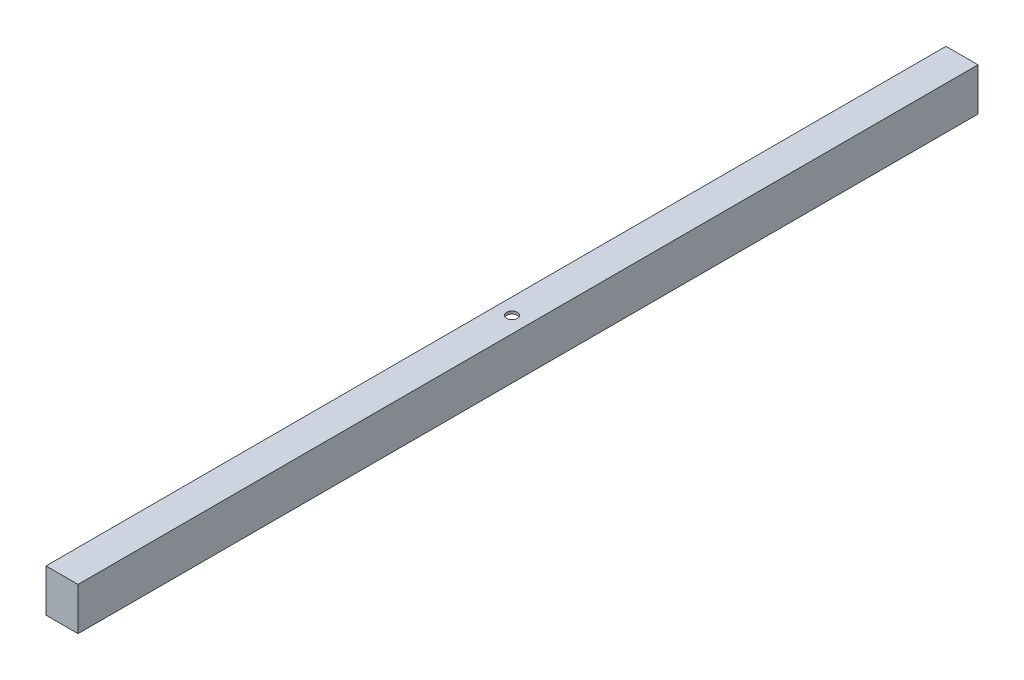
ISO-10303-21;
HEADER;
FILE_DESCRIPTION(('STEP AP214'),'2;1');
FILE_NAME('part.step','',(''),(''),'','','');
FILE_SCHEMA(('AUTOMOTIVE_DESIGN { 1 0 10303 214 1 1 1 1 }'));
ENDSEC;
DATA;
#1=APPLICATION_CONTEXT('core data for automotive mechanical design processes');
#2=APPLICATION_PROTOCOL_DEFINITION('international standard','automotive_design',2000,#1);
#3=PRODUCT_CONTEXT('',#1,'mechanical');
#4=PRODUCT('Part','Part','',(#3));
#5=PRODUCT_RELATED_PRODUCT_CATEGORY('part','',(#4));
#6=PRODUCT_DEFINITION_FORMATION('','',#4);
#7=PRODUCT_DEFINITION_CONTEXT('part definition',#1,'design');
#8=PRODUCT_DEFINITION('design','',#6,#7);
#9=PRODUCT_DEFINITION_SHAPE('','',#8);
#10=(LENGTH_UNIT() NAMED_UNIT(*) SI_UNIT(.MILLI.,.METRE.));
#11=(NAMED_UNIT(*) PLANE_ANGLE_UNIT() SI_UNIT($,.RADIAN.));
#12=(NAMED_UNIT(*) SI_UNIT($,.STERADIAN.) SOLID_ANGLE_UNIT());
#13=UNCERTAINTY_MEASURE_WITH_UNIT(LENGTH_MEASURE(1.E-05),#10,'distance_accuracy_value','');
#14=(GEOMETRIC_REPRESENTATION_CONTEXT(3) GLOBAL_UNCERTAINTY_ASSIGNED_CONTEXT((#13)) GLOBAL_UNIT_ASSIGNED_CONTEXT((#10,
#11,#12)) REPRESENTATION_CONTEXT('',''));
#15=CARTESIAN_POINT('',(0.,0.,0.));
#16=DIRECTION('',(0.,0.,1.));
#17=DIRECTION('',(1.,0.,0.));
#18=AXIS2_PLACEMENT_3D('',#15,#16,#17);
#19=CARTESIAN_POINT('',(0.,-23.8125,533.4));
#20=DIRECTION('',(0.,-1.,0.));
#21=DIRECTION('',(0.,0.,-1.));
#22=AXIS2_PLACEMENT_3D('',#19,#20,#21);
#23=PLANE('',#22);
#24=CARTESIAN_POINT('',(9.525,-23.8125,266.7));
#25=DIRECTION('',(0.,-1.,0.));
#26=DIRECTION('',(0.,0.,-1.));
#27=AXIS2_PLACEMENT_3D('',#24,#25,#26);
#28=CIRCLE('',#27,3.175);
#29=CARTESIAN_POINT('',(9.525,-23.8125,263.525));
#30=VERTEX_POINT('',#29);
#31=EDGE_CURVE('E145',#30,#30,#28,.T.);
#32=ORIENTED_EDGE('',*,*,#31,.F.);
#33=EDGE_LOOP('',(#32));
#34=FACE_BOUND('',#33,.T.);
#35=DIRECTION('',(0.,0.,-1.));
#36=VECTOR('',#35,1.);
#37=CARTESIAN_POINT('',(0.,-23.8125,533.4));
#38=LINE('',#37,#36);
#39=CARTESIAN_POINT('',(0.,-23.8125,534.416));
#40=VERTEX_POINT('',#39);
#41=CARTESIAN_POINT('',(0.,-23.8125,-1.016));
#42=VERTEX_POINT('',#41);
#43=EDGE_CURVE('E11',#40,#42,#38,.T.);
#44=ORIENTED_EDGE('',*,*,#43,.T.);
#45=DIRECTION('',(-1.,0.,0.));
#46=VECTOR('',#45,1.);
#47=CARTESIAN_POINT('',(19.05,-23.8125,-1.016));
#48=LINE('',#47,#46);
#49=CARTESIAN_POINT('',(19.05,-23.8125,-1.016));
#50=VERTEX_POINT('',#49);
#51=EDGE_CURVE('E131',#50,#42,#48,.T.);
#52=ORIENTED_EDGE('',*,*,#51,.F.);
#53=DIRECTION('',(0.,0.,-1.));
#54=VECTOR('',#53,1.);
#55=CARTESIAN_POINT('',(19.05,-23.8125,533.4));
#56=LINE('',#55,#54);
#57=CARTESIAN_POINT('',(19.05,-23.8125,534.416));
#58=VERTEX_POINT('',#57);
#59=EDGE_CURVE('E48',#58,#50,#56,.T.);
#60=ORIENTED_EDGE('',*,*,#59,.F.);
#61=DIRECTION('',(1.,0.,0.));
#62=VECTOR('',#61,1.);
#63=CARTESIAN_POINT('',(0.,-23.8125,534.416));
#64=LINE('',#63,#62);
#65=EDGE_CURVE('E110',#40,#58,#64,.T.);
#66=ORIENTED_EDGE('',*,*,#65,.F.);
#67=EDGE_LOOP('',(#44,#52,#60,#66));
#68=FACE_BOUND('',#67,.T.);
#69=ADVANCED_FACE('F39',(#34,#68),#23,.T.);
#70=CARTESIAN_POINT('',(19.05,0.,533.4));
#71=DIRECTION('',(1.,0.,0.));
#72=DIRECTION('',(0.,1.,0.));
#73=AXIS2_PLACEMENT_3D('',#70,#71,#72);
#74=PLANE('',#73);
#75=ORIENTED_EDGE('',*,*,#59,.T.);
#76=DIRECTION('',(0.,-1.,0.));
#77=VECTOR('',#76,1.);
#78=CARTESIAN_POINT('',(19.05,1.5875,-1.016));
#79=LINE('',#78,#77);
#80=CARTESIAN_POINT('',(19.05,1.5875,-1.016));
#81=VERTEX_POINT('',#80);
#82=EDGE_CURVE('E128',#81,#50,#79,.T.);
#83=ORIENTED_EDGE('',*,*,#82,.F.);
#84=DIRECTION('',(0.,0.,-1.));
#85=VECTOR('',#84,1.);
#86=CARTESIAN_POINT('',(19.05,1.5875,533.4));
#87=LINE('',#86,#85);
#88=CARTESIAN_POINT('',(19.05,1.5875,534.416));
#89=VERTEX_POINT('',#88);
#90=EDGE_CURVE('E177',#89,#81,#87,.T.);
#91=ORIENTED_EDGE('',*,*,#90,.F.);
#92=DIRECTION('',(0.,1.,0.));
#93=VECTOR('',#92,1.);
#94=CARTESIAN_POINT('',(19.05,1.5875,534.416));
#95=LINE('',#94,#93);
#96=EDGE_CURVE('E114',#58,#89,#95,.T.);
#97=ORIENTED_EDGE('',*,*,#96,.F.);
#98=EDGE_LOOP('',(#75,#83,#91,#97));
#99=FACE_BOUND('',#98,.T.);
#100=ADVANCED_FACE('F181',(#99),#74,.T.);
#101=CARTESIAN_POINT('',(0.,1.5875,533.4));
#102=DIRECTION('',(0.,1.,0.));
#103=DIRECTION('',(0.,0.,1.));
#104=AXIS2_PLACEMENT_3D('',#101,#102,#103);
#105=PLANE('',#104);
#106=CARTESIAN_POINT('',(9.525,1.5875,266.7));
#107=DIRECTION('',(0.,1.,0.));
#108=DIRECTION('',(0.,0.,1.));
#109=AXIS2_PLACEMENT_3D('',#106,#107,#108);
#110=CIRCLE('',#109,3.175);
#111=CARTESIAN_POINT('',(9.525,1.5875,269.875));
#112=VERTEX_POINT('',#111);
#113=EDGE_CURVE('E137',#112,#112,#110,.T.);
#114=ORIENTED_EDGE('',*,*,#113,.F.);
#115=EDGE_LOOP('',(#114));
#116=FACE_BOUND('',#115,.T.);
#117=ORIENTED_EDGE('',*,*,#90,.T.);
#118=DIRECTION('',(1.,0.,0.));
#119=VECTOR('',#118,1.);
#120=CARTESIAN_POINT('',(19.05,1.5875,-1.016));
#121=LINE('',#120,#119);
#122=CARTESIAN_POINT('',(0.,1.5875,-1.016));
#123=VERTEX_POINT('',#122);
#124=EDGE_CURVE('E134',#123,#81,#121,.T.);
#125=ORIENTED_EDGE('',*,*,#124,.F.);
#126=DIRECTION('',(0.,0.,-1.));
#127=VECTOR('',#126,1.);
#128=CARTESIAN_POINT('',(0.,1.5875,533.4));
#129=LINE('',#128,#127);
#130=CARTESIAN_POINT('',(0.,1.5875,534.416));
#131=VERTEX_POINT('',#130);
#132=EDGE_CURVE('E175',#131,#123,#129,.T.);
#133=ORIENTED_EDGE('',*,*,#132,.F.);
#134=DIRECTION('',(-1.,0.,0.));
#135=VECTOR('',#134,1.);
#136=CARTESIAN_POINT('',(0.,1.5875,534.416));
#137=LINE('',#136,#135);
#138=EDGE_CURVE('E119',#89,#131,#137,.T.);
#139=ORIENTED_EDGE('',*,*,#138,.F.);
#140=EDGE_LOOP('',(#117,#125,#133,#139));
#141=FACE_BOUND('',#140,.T.);
#142=ADVANCED_FACE('F186',(#116,#141),#105,.T.);
#143=CARTESIAN_POINT('',(0.,0.,533.4));
#144=DIRECTION('',(-1.,0.,0.));
#145=DIRECTION('',(0.,0.,1.));
#146=AXIS2_PLACEMENT_3D('',#143,#144,#145);
#147=PLANE('',#146);
#148=DIRECTION('',(0.,-1.,0.));
#149=VECTOR('',#148,1.);
#150=CARTESIAN_POINT('',(0.,1.5875,533.4));
#151=LINE('',#150,#149);
#152=CARTESIAN_POINT('',(0.,0.,533.4));
#153=VERTEX_POINT('',#152);
#154=CARTESIAN_POINT('',(0.,-22.225,533.4));
#155=VERTEX_POINT('',#154);
#156=EDGE_CURVE('E120',#153,#155,#151,.T.);
#157=ORIENTED_EDGE('',*,*,#156,.T.);
#158=DIRECTION('',(0.,0.,-1.));
#159=VECTOR('',#158,1.);
#160=CARTESIAN_POINT('',(0.,-22.225,533.4));
#161=LINE('',#160,#159);
#162=CARTESIAN_POINT('',(0.,-22.225,0.));
#163=VERTEX_POINT('',#162);
#164=EDGE_CURVE('E159',#155,#163,#161,.T.);
#165=ORIENTED_EDGE('',*,*,#164,.T.);
#166=DIRECTION('',(0.,1.,0.));
#167=VECTOR('',#166,1.);
#168=CARTESIAN_POINT('',(0.,1.5875,0.));
#169=LINE('',#168,#167);
#170=CARTESIAN_POINT('',(0.,0.,0.));
#171=VERTEX_POINT('',#170);
#172=EDGE_CURVE('E126',#163,#171,#169,.T.);
#173=ORIENTED_EDGE('',*,*,#172,.T.);
#174=DIRECTION('',(0.,0.,-1.));
#175=VECTOR('',#174,1.);
#176=CARTESIAN_POINT('',(0.,0.,533.4));
#177=LINE('',#176,#175);
#178=EDGE_CURVE('E172',#153,#171,#177,.T.);
#179=ORIENTED_EDGE('',*,*,#178,.F.);
#180=EDGE_LOOP('',(#157,#165,#173,#179));
#181=FACE_BOUND('',#180,.T.);
#182=ORIENTED_EDGE('',*,*,#132,.T.);
#183=DIRECTION('',(0.,1.,0.));
#184=VECTOR('',#183,1.);
#185=CARTESIAN_POINT('',(0.,1.5875,-1.016));
#186=LINE('',#185,#184);
#187=EDGE_CURVE('E105',#42,#123,#186,.T.);
#188=ORIENTED_EDGE('',*,*,#187,.F.);
#189=ORIENTED_EDGE('',*,*,#43,.F.);
#190=DIRECTION('',(0.,-1.,0.));
#191=VECTOR('',#190,1.);
#192=CARTESIAN_POINT('',(0.,1.5875,534.416));
#193=LINE('',#192,#191);
#194=EDGE_CURVE('E103',#131,#40,#193,.T.);
#195=ORIENTED_EDGE('',*,*,#194,.F.);
#196=EDGE_LOOP('',(#182,#188,#189,#195));
#197=FACE_BOUND('',#196,.T.);
#198=ADVANCED_FACE('F101',(#181,#197),#147,.T.);
#199=CARTESIAN_POINT('',(0.,0.,533.4));
#200=DIRECTION('',(0.,1.,0.));
#201=DIRECTION('',(0.,0.,1.));
#202=AXIS2_PLACEMENT_3D('',#199,#200,#201);
#203=PLANE('',#202);
#204=CARTESIAN_POINT('',(9.525,0.,266.7));
#205=DIRECTION('',(0.,1.,0.));
#206=DIRECTION('',(0.,0.,1.));
#207=AXIS2_PLACEMENT_3D('',#204,#205,#206);
#208=CIRCLE('',#207,3.175);
#209=CARTESIAN_POINT('',(9.525,0.,269.875));
#210=VERTEX_POINT('',#209);
#211=EDGE_CURVE('E142',#210,#210,#208,.T.);
#212=ORIENTED_EDGE('',*,*,#211,.T.);
#213=EDGE_LOOP('',(#212));
#214=FACE_BOUND('',#213,.T.);
#215=DIRECTION('',(1.,0.,0.));
#216=VECTOR('',#215,1.);
#217=CARTESIAN_POINT('',(0.,0.,0.));
#218=LINE('',#217,#216);
#219=CARTESIAN_POINT('',(17.4625,0.,0.));
#220=VERTEX_POINT('',#219);
#221=EDGE_CURVE('E148',#171,#220,#218,.T.);
#222=ORIENTED_EDGE('',*,*,#221,.T.);
#223=DIRECTION('',(0.,0.,-1.));
#224=VECTOR('',#223,1.);
#225=CARTESIAN_POINT('',(17.4625,0.,533.4));
#226=LINE('',#225,#224);
#227=CARTESIAN_POINT('',(17.4625,0.,533.4));
#228=VERTEX_POINT('',#227);
#229=EDGE_CURVE('E169',#228,#220,#226,.T.);
#230=ORIENTED_EDGE('',*,*,#229,.F.);
#231=DIRECTION('',(1.,0.,0.));
#232=VECTOR('',#231,1.);
#233=CARTESIAN_POINT('',(0.,0.,533.4));
#234=LINE('',#233,#232);
#235=EDGE_CURVE('E149',#153,#228,#234,.T.);
#236=ORIENTED_EDGE('',*,*,#235,.F.);
#237=ORIENTED_EDGE('',*,*,#178,.T.);
#238=EDGE_LOOP('',(#222,#230,#236,#237));
#239=FACE_BOUND('',#238,.T.);
#240=ADVANCED_FACE('F194',(#214,#239),#203,.F.);
#241=CARTESIAN_POINT('',(17.4625,0.,533.4));
#242=DIRECTION('',(1.,0.,0.));
#243=DIRECTION('',(0.,1.,0.));
#244=AXIS2_PLACEMENT_3D('',#241,#242,#243);
#245=PLANE('',#244);
#246=DIRECTION('',(0.,-1.,0.));
#247=VECTOR('',#246,1.);
#248=CARTESIAN_POINT('',(17.4625,0.,0.));
#249=LINE('',#248,#247);
#250=CARTESIAN_POINT('',(17.4625,-22.225,0.));
#251=VERTEX_POINT('',#250);
#252=EDGE_CURVE('E162',#220,#251,#249,.T.);
#253=ORIENTED_EDGE('',*,*,#252,.T.);
#254=DIRECTION('',(0.,0.,-1.));
#255=VECTOR('',#254,1.);
#256=CARTESIAN_POINT('',(17.4625,-22.225,533.4));
#257=LINE('',#256,#255);
#258=CARTESIAN_POINT('',(17.4625,-22.225,533.4));
#259=VERTEX_POINT('',#258);
#260=EDGE_CURVE('E55',#259,#251,#257,.T.);
#261=ORIENTED_EDGE('',*,*,#260,.F.);
#262=DIRECTION('',(0.,-1.,0.));
#263=VECTOR('',#262,1.);
#264=CARTESIAN_POINT('',(17.4625,0.,533.4));
#265=LINE('',#264,#263);
#266=EDGE_CURVE('E152',#228,#259,#265,.T.);
#267=ORIENTED_EDGE('',*,*,#266,.F.);
#268=ORIENTED_EDGE('',*,*,#229,.T.);
#269=EDGE_LOOP('',(#253,#261,#267,#268));
#270=FACE_BOUND('',#269,.T.);
#271=ADVANCED_FACE('F215',(#270),#245,.F.);
#272=CARTESIAN_POINT('',(0.,-22.225,533.4));
#273=DIRECTION('',(0.,-1.,0.));
#274=DIRECTION('',(1.,0.,0.));
#275=AXIS2_PLACEMENT_3D('',#272,#273,#274);
#276=PLANE('',#275);
#277=CARTESIAN_POINT('',(9.525,-22.225,266.7));
#278=DIRECTION('',(0.,-1.,0.));
#279=DIRECTION('',(1.,0.,0.));
#280=AXIS2_PLACEMENT_3D('',#277,#278,#279);
#281=CIRCLE('',#280,3.175);
#282=CARTESIAN_POINT('',(12.7,-22.225,266.7));
#283=VERTEX_POINT('',#282);
#284=EDGE_CURVE('E42',#283,#283,#281,.T.);
#285=ORIENTED_EDGE('',*,*,#284,.T.);
#286=EDGE_LOOP('',(#285));
#287=FACE_BOUND('',#286,.T.);
#288=DIRECTION('',(-1.,0.,0.));
#289=VECTOR('',#288,1.);
#290=CARTESIAN_POINT('',(0.,-22.225,0.));
#291=LINE('',#290,#289);
#292=EDGE_CURVE('E153',#251,#163,#291,.T.);
#293=ORIENTED_EDGE('',*,*,#292,.T.);
#294=ORIENTED_EDGE('',*,*,#164,.F.);
#295=DIRECTION('',(-1.,0.,0.));
#296=VECTOR('',#295,1.);
#297=CARTESIAN_POINT('',(0.,-22.225,533.4));
#298=LINE('',#297,#296);
#299=EDGE_CURVE('E156',#259,#155,#298,.T.);
#300=ORIENTED_EDGE('',*,*,#299,.F.);
#301=ORIENTED_EDGE('',*,*,#260,.T.);
#302=EDGE_LOOP('',(#293,#294,#300,#301));
#303=FACE_BOUND('',#302,.T.);
#304=ADVANCED_FACE('F208',(#287,#303),#276,.F.);
#305=CARTESIAN_POINT('',(9.525,-379.4125,266.7));
#306=DIRECTION('',(0.,1.,0.));
#307=DIRECTION('',(0.,0.,1.));
#308=AXIS2_PLACEMENT_3D('',#305,#306,#307);
#309=CYLINDRICAL_SURFACE('',#308,3.175);
#310=ORIENTED_EDGE('',*,*,#31,.T.);
#311=EDGE_LOOP('',(#310));
#312=FACE_BOUND('',#311,.T.);
#313=ORIENTED_EDGE('',*,*,#284,.F.);
#314=EDGE_LOOP('',(#313));
#315=FACE_BOUND('',#314,.T.);
#316=ADVANCED_FACE('F204',(#312,#315),#309,.F.);
#317=ORIENTED_EDGE('',*,*,#113,.T.);
#318=EDGE_LOOP('',(#317));
#319=FACE_BOUND('',#318,.T.);
#320=ORIENTED_EDGE('',*,*,#211,.F.);
#321=EDGE_LOOP('',(#320));
#322=FACE_BOUND('',#321,.T.);
#323=ADVANCED_FACE('F207',(#319,#322),#309,.F.);
#324=CARTESIAN_POINT('',(0.,0.,-1.016));
#325=DIRECTION('',(0.,0.,-1.));
#326=DIRECTION('',(-1.,0.,0.));
#327=AXIS2_PLACEMENT_3D('',#324,#325,#326);
#328=PLANE('',#327);
#329=ORIENTED_EDGE('',*,*,#82,.T.);
#330=ORIENTED_EDGE('',*,*,#51,.T.);
#331=ORIENTED_EDGE('',*,*,#187,.T.);
#332=ORIENTED_EDGE('',*,*,#124,.T.);
#333=EDGE_LOOP('',(#329,#330,#331,#332));
#334=FACE_BOUND('',#333,.T.);
#335=ADVANCED_FACE('F183',(#334),#328,.T.);
#336=CARTESIAN_POINT('',(0.,0.,0.));
#337=DIRECTION('',(0.,0.,-1.));
#338=DIRECTION('',(-1.,0.,0.));
#339=AXIS2_PLACEMENT_3D('',#336,#337,#338);
#340=PLANE('',#339);
#341=ORIENTED_EDGE('',*,*,#292,.F.);
#342=ORIENTED_EDGE('',*,*,#252,.F.);
#343=ORIENTED_EDGE('',*,*,#221,.F.);
#344=ORIENTED_EDGE('',*,*,#172,.F.);
#345=EDGE_LOOP('',(#341,#342,#343,#344));
#346=FACE_BOUND('',#345,.T.);
#347=ADVANCED_FACE('F219',(#346),#340,.F.);
#348=CARTESIAN_POINT('',(0.,0.,533.4));
#349=DIRECTION('',(0.,0.,1.));
#350=DIRECTION('',(1.,0.,0.));
#351=AXIS2_PLACEMENT_3D('',#348,#349,#350);
#352=PLANE('',#351);
#353=ORIENTED_EDGE('',*,*,#156,.F.);
#354=ORIENTED_EDGE('',*,*,#235,.T.);
#355=ORIENTED_EDGE('',*,*,#266,.T.);
#356=ORIENTED_EDGE('',*,*,#299,.T.);
#357=EDGE_LOOP('',(#353,#354,#355,#356));
#358=FACE_BOUND('',#357,.T.);
#359=ADVANCED_FACE('F224',(#358),#352,.F.);
#360=CARTESIAN_POINT('',(0.,0.,534.416));
#361=DIRECTION('',(0.,0.,1.));
#362=DIRECTION('',(1.,0.,0.));
#363=AXIS2_PLACEMENT_3D('',#360,#361,#362);
#364=PLANE('',#363);
#365=ORIENTED_EDGE('',*,*,#194,.T.);
#366=ORIENTED_EDGE('',*,*,#65,.T.);
#367=ORIENTED_EDGE('',*,*,#96,.T.);
#368=ORIENTED_EDGE('',*,*,#138,.T.);
#369=EDGE_LOOP('',(#365,#366,#367,#368));
#370=FACE_BOUND('',#369,.T.);
#371=ADVANCED_FACE('F117',(#370),#364,.T.);
#372=CLOSED_SHELL('',(#69,#100,#142,#198,#240,#271,#304,#316,#323,#335,#347,#359,#371));
#373=MANIFOLD_SOLID_BREP('B2',#372);
#374=ADVANCED_BREP_SHAPE_REPRESENTATION('',(#18,#373),#14);
#375=SHAPE_DEFINITION_REPRESENTATION(#9,#374);
ENDSEC;
END-ISO-10303-21;
